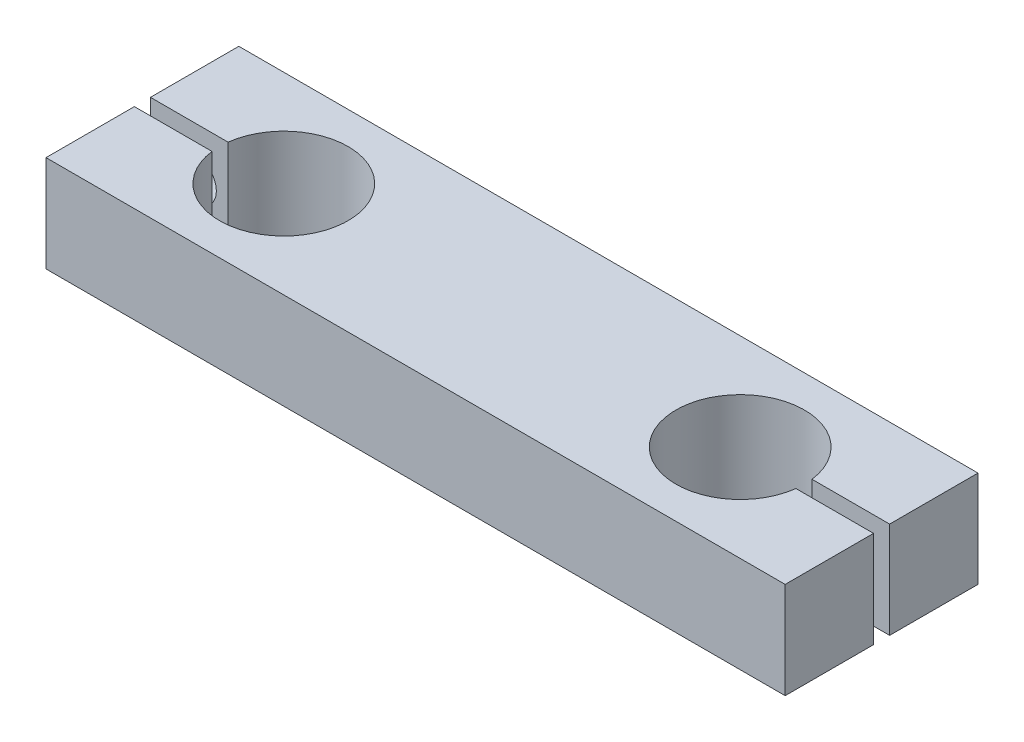
ISO-10303-21;
HEADER;
FILE_DESCRIPTION(('STEP AP214'),'2;1');
FILE_NAME('part.step','',(''),(''),'','','');
FILE_SCHEMA(('AUTOMOTIVE_DESIGN { 1 0 10303 214 1 1 1 1 }'));
ENDSEC;
DATA;
#1=APPLICATION_CONTEXT('core data for automotive mechanical design processes');
#2=APPLICATION_PROTOCOL_DEFINITION('international standard','automotive_design',2000,#1);
#3=PRODUCT_CONTEXT('',#1,'mechanical');
#4=PRODUCT('Part','Part','',(#3));
#5=PRODUCT_RELATED_PRODUCT_CATEGORY('part','',(#4));
#6=PRODUCT_DEFINITION_FORMATION('','',#4);
#7=PRODUCT_DEFINITION_CONTEXT('part definition',#1,'design');
#8=PRODUCT_DEFINITION('design','',#6,#7);
#9=PRODUCT_DEFINITION_SHAPE('','',#8);
#10=(LENGTH_UNIT() NAMED_UNIT(*) SI_UNIT(.MILLI.,.METRE.));
#11=(NAMED_UNIT(*) PLANE_ANGLE_UNIT() SI_UNIT($,.RADIAN.));
#12=(NAMED_UNIT(*) SI_UNIT($,.STERADIAN.) SOLID_ANGLE_UNIT());
#13=UNCERTAINTY_MEASURE_WITH_UNIT(LENGTH_MEASURE(1.E-05),#10,'distance_accuracy_value','');
#14=(GEOMETRIC_REPRESENTATION_CONTEXT(3) GLOBAL_UNCERTAINTY_ASSIGNED_CONTEXT((#13)) GLOBAL_UNIT_ASSIGNED_CONTEXT((#10,
#11,#12)) REPRESENTATION_CONTEXT('',''));
#15=CARTESIAN_POINT('',(0.,0.,0.));
#16=DIRECTION('',(0.,0.,1.));
#17=DIRECTION('',(1.,0.,0.));
#18=AXIS2_PLACEMENT_3D('',#15,#16,#17);
#19=CARTESIAN_POINT('',(35.5,15.,0.));
#20=DIRECTION('',(0.,-1.,0.));
#21=DIRECTION('',(0.,0.,-1.));
#22=AXIS2_PLACEMENT_3D('',#19,#20,#21);
#23=CYLINDRICAL_SURFACE('',#22,10.);
#24=CARTESIAN_POINT('',(35.5,0.,0.));
#25=DIRECTION('',(0.,1.,0.));
#26=DIRECTION('',(0.,0.,1.));
#27=AXIS2_PLACEMENT_3D('',#24,#25,#26);
#28=CIRCLE('',#27,10.);
#29=CARTESIAN_POINT('',(45.4215674164922,0.,-1.25));
#30=VERTEX_POINT('',#29);
#31=CARTESIAN_POINT('',(45.4215674164922,0.,1.25));
#32=VERTEX_POINT('',#31);
#33=EDGE_CURVE('E201',#30,#32,#28,.T.);
#34=ORIENTED_EDGE('',*,*,#33,.F.);
#35=DIRECTION('',(0.,-1.,0.));
#36=VECTOR('',#35,1.);
#37=CARTESIAN_POINT('',(45.4215674164922,15.,-1.25));
#38=LINE('',#37,#36);
#39=CARTESIAN_POINT('',(45.4215674164922,15.,-1.25));
#40=VERTEX_POINT('',#39);
#41=EDGE_CURVE('E11',#40,#30,#38,.T.);
#42=ORIENTED_EDGE('',*,*,#41,.F.);
#43=CARTESIAN_POINT('',(35.5,15.,0.));
#44=DIRECTION('',(0.,1.,0.));
#45=DIRECTION('',(0.,0.,1.));
#46=AXIS2_PLACEMENT_3D('',#43,#44,#45);
#47=CIRCLE('',#46,10.);
#48=CARTESIAN_POINT('',(45.4215674164922,15.,1.25));
#49=VERTEX_POINT('',#48);
#50=EDGE_CURVE('E178',#40,#49,#47,.T.);
#51=ORIENTED_EDGE('',*,*,#50,.T.);
#52=DIRECTION('',(0.,-1.,0.));
#53=VECTOR('',#52,1.);
#54=CARTESIAN_POINT('',(45.4215674164922,15.,1.25));
#55=LINE('',#54,#53);
#56=EDGE_CURVE('E106',#49,#32,#55,.T.);
#57=ORIENTED_EDGE('',*,*,#56,.T.);
#58=EDGE_LOOP('',(#34,#42,#51,#57));
#59=FACE_BOUND('',#58,.T.);
#60=ADVANCED_FACE('F41',(#59),#23,.F.);
#61=CARTESIAN_POINT('',(0.,15.,-1.25));
#62=DIRECTION('',(0.,0.,-1.));
#63=DIRECTION('',(-1.,0.,0.));
#64=AXIS2_PLACEMENT_3D('',#61,#62,#63);
#65=PLANE('',#64);
#66=CARTESIAN_POINT('',(50.5,7.5,-1.25));
#67=DIRECTION('',(0.,0.,-1.));
#68=DIRECTION('',(-1.,0.,0.));
#69=AXIS2_PLACEMENT_3D('',#66,#67,#68);
#70=CIRCLE('',#69,3.25);
#71=CARTESIAN_POINT('',(47.25,7.5,-1.25));
#72=VERTEX_POINT('',#71);
#73=EDGE_CURVE('E205',#72,#72,#70,.T.);
#74=ORIENTED_EDGE('',*,*,#73,.T.);
#75=EDGE_LOOP('',(#74));
#76=FACE_BOUND('',#75,.T.);
#77=DIRECTION('',(1.,0.,0.));
#78=VECTOR('',#77,1.);
#79=CARTESIAN_POINT('',(0.,0.,-1.25));
#80=LINE('',#79,#78);
#81=CARTESIAN_POINT('',(57.5,0.,-1.25));
#82=VERTEX_POINT('',#81);
#83=EDGE_CURVE('E288',#30,#82,#80,.T.);
#84=ORIENTED_EDGE('',*,*,#83,.T.);
#85=DIRECTION('',(0.,-1.,0.));
#86=VECTOR('',#85,1.);
#87=CARTESIAN_POINT('',(57.5,15.,-1.25));
#88=LINE('',#87,#86);
#89=CARTESIAN_POINT('',(57.5,15.,-1.25));
#90=VERTEX_POINT('',#89);
#91=EDGE_CURVE('E51',#90,#82,#88,.T.);
#92=ORIENTED_EDGE('',*,*,#91,.F.);
#93=DIRECTION('',(1.,0.,0.));
#94=VECTOR('',#93,1.);
#95=CARTESIAN_POINT('',(0.,15.,-1.25));
#96=LINE('',#95,#94);
#97=EDGE_CURVE('E171',#40,#90,#96,.T.);
#98=ORIENTED_EDGE('',*,*,#97,.F.);
#99=ORIENTED_EDGE('',*,*,#41,.T.);
#100=EDGE_LOOP('',(#84,#92,#98,#99));
#101=FACE_BOUND('',#100,.T.);
#102=ADVANCED_FACE('F349',(#76,#101),#65,.F.);
#103=CARTESIAN_POINT('',(57.5,15.,0.));
#104=DIRECTION('',(1.,0.,0.));
#105=DIRECTION('',(0.,0.,-1.));
#106=AXIS2_PLACEMENT_3D('',#103,#104,#105);
#107=PLANE('',#106);
#108=DIRECTION('',(0.,0.,1.));
#109=VECTOR('',#108,1.);
#110=CARTESIAN_POINT('',(57.5,0.,0.));
#111=LINE('',#110,#109);
#112=CARTESIAN_POINT('',(57.5,0.,-15.));
#113=VERTEX_POINT('',#112);
#114=EDGE_CURVE('E284',#113,#82,#111,.T.);
#115=ORIENTED_EDGE('',*,*,#114,.F.);
#116=DIRECTION('',(0.,-1.,0.));
#117=VECTOR('',#116,1.);
#118=CARTESIAN_POINT('',(57.5,15.,-15.));
#119=LINE('',#118,#117);
#120=CARTESIAN_POINT('',(57.5,15.,-15.));
#121=VERTEX_POINT('',#120);
#122=EDGE_CURVE('E234',#121,#113,#119,.T.);
#123=ORIENTED_EDGE('',*,*,#122,.F.);
#124=DIRECTION('',(0.,0.,1.));
#125=VECTOR('',#124,1.);
#126=CARTESIAN_POINT('',(57.5,15.,0.));
#127=LINE('',#126,#125);
#128=EDGE_CURVE('E163',#121,#90,#127,.T.);
#129=ORIENTED_EDGE('',*,*,#128,.T.);
#130=ORIENTED_EDGE('',*,*,#91,.T.);
#131=EDGE_LOOP('',(#115,#123,#129,#130));
#132=FACE_BOUND('',#131,.T.);
#133=ADVANCED_FACE('F353',(#132),#107,.T.);
#134=CARTESIAN_POINT('',(0.,15.,-15.));
#135=DIRECTION('',(0.,0.,-1.));
#136=DIRECTION('',(-1.,0.,0.));
#137=AXIS2_PLACEMENT_3D('',#134,#135,#136);
#138=PLANE('',#137);
#139=CARTESIAN_POINT('',(50.5,7.5,-15.));
#140=DIRECTION('',(0.,0.,-1.));
#141=DIRECTION('',(-1.,0.,0.));
#142=AXIS2_PLACEMENT_3D('',#139,#140,#141);
#143=CIRCLE('',#142,5.25);
#144=CARTESIAN_POINT('',(45.25,7.5,-15.));
#145=VERTEX_POINT('',#144);
#146=EDGE_CURVE('E193',#145,#145,#143,.T.);
#147=ORIENTED_EDGE('',*,*,#146,.F.);
#148=EDGE_LOOP('',(#147));
#149=FACE_BOUND('',#148,.T.);
#150=CARTESIAN_POINT('',(-50.5,7.5,-15.));
#151=DIRECTION('',(0.,0.,-1.));
#152=DIRECTION('',(-1.,0.,0.));
#153=AXIS2_PLACEMENT_3D('',#150,#151,#152);
#154=CIRCLE('',#153,5.25);
#155=CARTESIAN_POINT('',(-55.75,7.5,-15.));
#156=VERTEX_POINT('',#155);
#157=EDGE_CURVE('E184',#156,#156,#154,.T.);
#158=ORIENTED_EDGE('',*,*,#157,.F.);
#159=EDGE_LOOP('',(#158));
#160=FACE_BOUND('',#159,.T.);
#161=DIRECTION('',(1.,0.,0.));
#162=VECTOR('',#161,1.);
#163=CARTESIAN_POINT('',(0.,0.,-15.));
#164=LINE('',#163,#162);
#165=CARTESIAN_POINT('',(-57.5,0.,-15.));
#166=VERTEX_POINT('',#165);
#167=EDGE_CURVE('E280',#166,#113,#164,.T.);
#168=ORIENTED_EDGE('',*,*,#167,.F.);
#169=DIRECTION('',(0.,-1.,0.));
#170=VECTOR('',#169,1.);
#171=CARTESIAN_POINT('',(-57.5,15.,-15.));
#172=LINE('',#171,#170);
#173=CARTESIAN_POINT('',(-57.5,15.,-15.));
#174=VERTEX_POINT('',#173);
#175=EDGE_CURVE('E237',#174,#166,#172,.T.);
#176=ORIENTED_EDGE('',*,*,#175,.F.);
#177=DIRECTION('',(1.,0.,0.));
#178=VECTOR('',#177,1.);
#179=CARTESIAN_POINT('',(0.,15.,-15.));
#180=LINE('',#179,#178);
#181=EDGE_CURVE('E170',#174,#121,#180,.T.);
#182=ORIENTED_EDGE('',*,*,#181,.T.);
#183=ORIENTED_EDGE('',*,*,#122,.T.);
#184=EDGE_LOOP('',(#168,#176,#182,#183));
#185=FACE_BOUND('',#184,.T.);
#186=ADVANCED_FACE('F360',(#149,#160,#185),#138,.T.);
#187=CARTESIAN_POINT('',(-57.5,15.,0.));
#188=DIRECTION('',(1.,0.,0.));
#189=DIRECTION('',(0.,0.,-1.));
#190=AXIS2_PLACEMENT_3D('',#187,#188,#189);
#191=PLANE('',#190);
#192=DIRECTION('',(0.,0.,1.));
#193=VECTOR('',#192,1.);
#194=CARTESIAN_POINT('',(-57.5,0.,0.));
#195=LINE('',#194,#193);
#196=CARTESIAN_POINT('',(-57.5,0.,-1.25));
#197=VERTEX_POINT('',#196);
#198=EDGE_CURVE('E276',#166,#197,#195,.T.);
#199=ORIENTED_EDGE('',*,*,#198,.T.);
#200=DIRECTION('',(0.,-1.,0.));
#201=VECTOR('',#200,1.);
#202=CARTESIAN_POINT('',(-57.5,15.,-1.25));
#203=LINE('',#202,#201);
#204=CARTESIAN_POINT('',(-57.5,15.,-1.25));
#205=VERTEX_POINT('',#204);
#206=EDGE_CURVE('E240',#205,#197,#203,.T.);
#207=ORIENTED_EDGE('',*,*,#206,.F.);
#208=DIRECTION('',(0.,0.,1.));
#209=VECTOR('',#208,1.);
#210=CARTESIAN_POINT('',(-57.5,15.,0.));
#211=LINE('',#210,#209);
#212=EDGE_CURVE('E177',#174,#205,#211,.T.);
#213=ORIENTED_EDGE('',*,*,#212,.F.);
#214=ORIENTED_EDGE('',*,*,#175,.T.);
#215=EDGE_LOOP('',(#199,#207,#213,#214));
#216=FACE_BOUND('',#215,.T.);
#217=ADVANCED_FACE('F315',(#216),#191,.F.);
#218=CARTESIAN_POINT('',(0.,15.,-1.25));
#219=DIRECTION('',(0.,0.,1.));
#220=DIRECTION('',(1.,0.,0.));
#221=AXIS2_PLACEMENT_3D('',#218,#219,#220);
#222=PLANE('',#221);
#223=CARTESIAN_POINT('',(-50.5,7.5,-1.25));
#224=DIRECTION('',(0.,0.,1.));
#225=DIRECTION('',(1.,0.,0.));
#226=AXIS2_PLACEMENT_3D('',#223,#224,#225);
#227=CIRCLE('',#226,3.25);
#228=CARTESIAN_POINT('',(-47.25,7.5,-1.25));
#229=VERTEX_POINT('',#228);
#230=EDGE_CURVE('E189',#229,#229,#227,.T.);
#231=ORIENTED_EDGE('',*,*,#230,.F.);
#232=EDGE_LOOP('',(#231));
#233=FACE_BOUND('',#232,.T.);
#234=DIRECTION('',(-1.,0.,0.));
#235=VECTOR('',#234,1.);
#236=CARTESIAN_POINT('',(0.,0.,-1.25));
#237=LINE('',#236,#235);
#238=CARTESIAN_POINT('',(-45.4215674164922,0.,-1.25));
#239=VERTEX_POINT('',#238);
#240=EDGE_CURVE('E272',#239,#197,#237,.T.);
#241=ORIENTED_EDGE('',*,*,#240,.F.);
#242=DIRECTION('',(0.,-1.,0.));
#243=VECTOR('',#242,1.);
#244=CARTESIAN_POINT('',(-45.4215674164922,15.,-1.25));
#245=LINE('',#244,#243);
#246=CARTESIAN_POINT('',(-45.4215674164922,15.,-1.25));
#247=VERTEX_POINT('',#246);
#248=EDGE_CURVE('E243',#247,#239,#245,.T.);
#249=ORIENTED_EDGE('',*,*,#248,.F.);
#250=DIRECTION('',(-1.,0.,0.));
#251=VECTOR('',#250,1.);
#252=CARTESIAN_POINT('',(0.,15.,-1.25));
#253=LINE('',#252,#251);
#254=EDGE_CURVE('E303',#247,#205,#253,.T.);
#255=ORIENTED_EDGE('',*,*,#254,.T.);
#256=ORIENTED_EDGE('',*,*,#206,.T.);
#257=EDGE_LOOP('',(#241,#249,#255,#256));
#258=FACE_BOUND('',#257,.T.);
#259=ADVANCED_FACE('F319',(#233,#258),#222,.T.);
#260=CARTESIAN_POINT('',(-35.5,15.,0.));
#261=DIRECTION('',(0.,-1.,0.));
#262=DIRECTION('',(0.,0.,-1.));
#263=AXIS2_PLACEMENT_3D('',#260,#261,#262);
#264=CYLINDRICAL_SURFACE('',#263,10.);
#265=CARTESIAN_POINT('',(-35.5,0.,0.));
#266=DIRECTION('',(0.,1.,0.));
#267=DIRECTION('',(0.,0.,1.));
#268=AXIS2_PLACEMENT_3D('',#265,#266,#267);
#269=CIRCLE('',#268,10.);
#270=CARTESIAN_POINT('',(-45.4215674164922,0.,1.25000000000001));
#271=VERTEX_POINT('',#270);
#272=EDGE_CURVE('E268',#271,#239,#269,.T.);
#273=ORIENTED_EDGE('',*,*,#272,.F.);
#274=DIRECTION('',(0.,-1.,0.));
#275=VECTOR('',#274,1.);
#276=CARTESIAN_POINT('',(-45.4215674164922,15.,1.25000000000001));
#277=LINE('',#276,#275);
#278=CARTESIAN_POINT('',(-45.4215674164922,15.,1.25000000000001));
#279=VERTEX_POINT('',#278);
#280=EDGE_CURVE('E246',#279,#271,#277,.T.);
#281=ORIENTED_EDGE('',*,*,#280,.F.);
#282=CARTESIAN_POINT('',(-35.5,15.,0.));
#283=DIRECTION('',(0.,1.,0.));
#284=DIRECTION('',(0.,0.,1.));
#285=AXIS2_PLACEMENT_3D('',#282,#283,#284);
#286=CIRCLE('',#285,10.);
#287=EDGE_CURVE('E299',#279,#247,#286,.T.);
#288=ORIENTED_EDGE('',*,*,#287,.T.);
#289=ORIENTED_EDGE('',*,*,#248,.T.);
#290=EDGE_LOOP('',(#273,#281,#288,#289));
#291=FACE_BOUND('',#290,.T.);
#292=ADVANCED_FACE('F322',(#291),#264,.F.);
#293=CARTESIAN_POINT('',(0.,15.,1.25000000000001));
#294=DIRECTION('',(0.,0.,-1.));
#295=DIRECTION('',(-1.,0.,0.));
#296=AXIS2_PLACEMENT_3D('',#293,#294,#295);
#297=PLANE('',#296);
#298=CARTESIAN_POINT('',(-50.5,7.5,1.25));
#299=DIRECTION('',(0.,0.,-1.));
#300=DIRECTION('',(-1.,0.,0.));
#301=AXIS2_PLACEMENT_3D('',#298,#299,#300);
#302=CIRCLE('',#301,3.25);
#303=CARTESIAN_POINT('',(-53.75,7.5,1.25));
#304=VERTEX_POINT('',#303);
#305=EDGE_CURVE('E44',#304,#304,#302,.T.);
#306=ORIENTED_EDGE('',*,*,#305,.F.);
#307=EDGE_LOOP('',(#306));
#308=FACE_BOUND('',#307,.T.);
#309=DIRECTION('',(1.,0.,0.));
#310=VECTOR('',#309,1.);
#311=CARTESIAN_POINT('',(0.,0.,1.25000000000001));
#312=LINE('',#311,#310);
#313=CARTESIAN_POINT('',(-57.5,0.,1.25000000000001));
#314=VERTEX_POINT('',#313);
#315=EDGE_CURVE('E264',#314,#271,#312,.T.);
#316=ORIENTED_EDGE('',*,*,#315,.F.);
#317=DIRECTION('',(0.,-1.,0.));
#318=VECTOR('',#317,1.);
#319=CARTESIAN_POINT('',(-57.5,15.,1.25000000000001));
#320=LINE('',#319,#318);
#321=CARTESIAN_POINT('',(-57.5,15.,1.25000000000001));
#322=VERTEX_POINT('',#321);
#323=EDGE_CURVE('E249',#322,#314,#320,.T.);
#324=ORIENTED_EDGE('',*,*,#323,.F.);
#325=DIRECTION('',(1.,0.,0.));
#326=VECTOR('',#325,1.);
#327=CARTESIAN_POINT('',(0.,15.,1.25000000000001));
#328=LINE('',#327,#326);
#329=EDGE_CURVE('E295',#322,#279,#328,.T.);
#330=ORIENTED_EDGE('',*,*,#329,.T.);
#331=ORIENTED_EDGE('',*,*,#280,.T.);
#332=EDGE_LOOP('',(#316,#324,#330,#331));
#333=FACE_BOUND('',#332,.T.);
#334=ADVANCED_FACE('F325',(#308,#333),#297,.T.);
#335=CARTESIAN_POINT('',(-57.5,0.,15.));
#336=VERTEX_POINT('',#335);
#337=EDGE_CURVE('E263',#314,#336,#195,.T.);
#338=ORIENTED_EDGE('',*,*,#337,.T.);
#339=DIRECTION('',(0.,-1.,0.));
#340=VECTOR('',#339,1.);
#341=CARTESIAN_POINT('',(-57.5,15.,15.));
#342=LINE('',#341,#340);
#343=CARTESIAN_POINT('',(-57.5,15.,15.));
#344=VERTEX_POINT('',#343);
#345=EDGE_CURVE('E158',#344,#336,#342,.T.);
#346=ORIENTED_EDGE('',*,*,#345,.F.);
#347=EDGE_CURVE('E143',#322,#344,#211,.T.);
#348=ORIENTED_EDGE('',*,*,#347,.F.);
#349=ORIENTED_EDGE('',*,*,#323,.T.);
#350=EDGE_LOOP('',(#338,#346,#348,#349));
#351=FACE_BOUND('',#350,.T.);
#352=ADVANCED_FACE('F328',(#351),#191,.F.);
#353=CARTESIAN_POINT('',(0.,15.,15.));
#354=DIRECTION('',(0.,0.,-1.));
#355=DIRECTION('',(-1.,0.,0.));
#356=AXIS2_PLACEMENT_3D('',#353,#354,#355);
#357=PLANE('',#356);
#358=DIRECTION('',(1.,0.,0.));
#359=VECTOR('',#358,1.);
#360=CARTESIAN_POINT('',(0.,0.,15.));
#361=LINE('',#360,#359);
#362=CARTESIAN_POINT('',(57.5,0.,15.));
#363=VERTEX_POINT('',#362);
#364=EDGE_CURVE('E153',#336,#363,#361,.T.);
#365=ORIENTED_EDGE('',*,*,#364,.T.);
#366=DIRECTION('',(0.,-1.,0.));
#367=VECTOR('',#366,1.);
#368=CARTESIAN_POINT('',(57.5,15.,15.));
#369=LINE('',#368,#367);
#370=CARTESIAN_POINT('',(57.5,15.,15.));
#371=VERTEX_POINT('',#370);
#372=EDGE_CURVE('E150',#371,#363,#369,.T.);
#373=ORIENTED_EDGE('',*,*,#372,.F.);
#374=DIRECTION('',(1.,0.,0.));
#375=VECTOR('',#374,1.);
#376=CARTESIAN_POINT('',(0.,15.,15.));
#377=LINE('',#376,#375);
#378=EDGE_CURVE('E136',#344,#371,#377,.T.);
#379=ORIENTED_EDGE('',*,*,#378,.F.);
#380=ORIENTED_EDGE('',*,*,#345,.T.);
#381=EDGE_LOOP('',(#365,#373,#379,#380));
#382=FACE_BOUND('',#381,.T.);
#383=ADVANCED_FACE('F151',(#382),#357,.F.);
#384=CARTESIAN_POINT('',(57.5,0.,1.25));
#385=VERTEX_POINT('',#384);
#386=EDGE_CURVE('E260',#385,#363,#111,.T.);
#387=ORIENTED_EDGE('',*,*,#386,.F.);
#388=DIRECTION('',(0.,-1.,0.));
#389=VECTOR('',#388,1.);
#390=CARTESIAN_POINT('',(57.5,15.,1.25));
#391=LINE('',#390,#389);
#392=CARTESIAN_POINT('',(57.5,15.,1.25));
#393=VERTEX_POINT('',#392);
#394=EDGE_CURVE('E99',#393,#385,#391,.T.);
#395=ORIENTED_EDGE('',*,*,#394,.F.);
#396=EDGE_CURVE('E140',#393,#371,#127,.T.);
#397=ORIENTED_EDGE('',*,*,#396,.T.);
#398=ORIENTED_EDGE('',*,*,#372,.T.);
#399=EDGE_LOOP('',(#387,#395,#397,#398));
#400=FACE_BOUND('',#399,.T.);
#401=ADVANCED_FACE('F160',(#400),#107,.T.);
#402=CARTESIAN_POINT('',(0.,15.,1.25));
#403=DIRECTION('',(0.,0.,1.));
#404=DIRECTION('',(1.,0.,0.));
#405=AXIS2_PLACEMENT_3D('',#402,#403,#404);
#406=PLANE('',#405);
#407=CARTESIAN_POINT('',(50.5,7.5,1.25));
#408=DIRECTION('',(0.,0.,1.));
#409=DIRECTION('',(1.,0.,0.));
#410=AXIS2_PLACEMENT_3D('',#407,#408,#409);
#411=CIRCLE('',#410,3.25);
#412=CARTESIAN_POINT('',(53.75,7.5,1.25));
#413=VERTEX_POINT('',#412);
#414=EDGE_CURVE('E209',#413,#413,#411,.T.);
#415=ORIENTED_EDGE('',*,*,#414,.T.);
#416=EDGE_LOOP('',(#415));
#417=FACE_BOUND('',#416,.T.);
#418=DIRECTION('',(-1.,0.,0.));
#419=VECTOR('',#418,1.);
#420=CARTESIAN_POINT('',(0.,0.,1.25));
#421=LINE('',#420,#419);
#422=EDGE_CURVE('E181',#385,#32,#421,.T.);
#423=ORIENTED_EDGE('',*,*,#422,.T.);
#424=ORIENTED_EDGE('',*,*,#56,.F.);
#425=DIRECTION('',(-1.,0.,0.));
#426=VECTOR('',#425,1.);
#427=CARTESIAN_POINT('',(0.,15.,1.25));
#428=LINE('',#427,#426);
#429=EDGE_CURVE('E60',#393,#49,#428,.T.);
#430=ORIENTED_EDGE('',*,*,#429,.F.);
#431=ORIENTED_EDGE('',*,*,#394,.T.);
#432=EDGE_LOOP('',(#423,#424,#430,#431));
#433=FACE_BOUND('',#432,.T.);
#434=ADVANCED_FACE('F404',(#417,#433),#406,.F.);
#435=CARTESIAN_POINT('',(0.,15.,0.));
#436=DIRECTION('',(0.,1.,0.));
#437=DIRECTION('',(0.,0.,1.));
#438=AXIS2_PLACEMENT_3D('',#435,#436,#437);
#439=PLANE('',#438);
#440=ORIENTED_EDGE('',*,*,#50,.F.);
#441=ORIENTED_EDGE('',*,*,#97,.T.);
#442=ORIENTED_EDGE('',*,*,#128,.F.);
#443=ORIENTED_EDGE('',*,*,#181,.F.);
#444=ORIENTED_EDGE('',*,*,#212,.T.);
#445=ORIENTED_EDGE('',*,*,#254,.F.);
#446=ORIENTED_EDGE('',*,*,#287,.F.);
#447=ORIENTED_EDGE('',*,*,#329,.F.);
#448=ORIENTED_EDGE('',*,*,#347,.T.);
#449=ORIENTED_EDGE('',*,*,#378,.T.);
#450=ORIENTED_EDGE('',*,*,#396,.F.);
#451=ORIENTED_EDGE('',*,*,#429,.T.);
#452=EDGE_LOOP('',(#440,#441,#442,#443,#444,#445,#446,#447,#448,#449,#450,#451));
#453=FACE_BOUND('',#452,.T.);
#454=ADVANCED_FACE('F138',(#453),#439,.T.);
#455=CARTESIAN_POINT('',(0.,0.,0.));
#456=DIRECTION('',(0.,1.,0.));
#457=DIRECTION('',(0.,0.,1.));
#458=AXIS2_PLACEMENT_3D('',#455,#456,#457);
#459=PLANE('',#458);
#460=ORIENTED_EDGE('',*,*,#33,.T.);
#461=ORIENTED_EDGE('',*,*,#422,.F.);
#462=ORIENTED_EDGE('',*,*,#386,.T.);
#463=ORIENTED_EDGE('',*,*,#364,.F.);
#464=ORIENTED_EDGE('',*,*,#337,.F.);
#465=ORIENTED_EDGE('',*,*,#315,.T.);
#466=ORIENTED_EDGE('',*,*,#272,.T.);
#467=ORIENTED_EDGE('',*,*,#240,.T.);
#468=ORIENTED_EDGE('',*,*,#198,.F.);
#469=ORIENTED_EDGE('',*,*,#167,.T.);
#470=ORIENTED_EDGE('',*,*,#114,.T.);
#471=ORIENTED_EDGE('',*,*,#83,.F.);
#472=EDGE_LOOP('',(#460,#461,#462,#463,#464,#465,#466,#467,#468,#469,#470,#471));
#473=FACE_BOUND('',#472,.T.);
#474=ADVANCED_FACE('F330',(#473),#459,.F.);
#475=CARTESIAN_POINT('',(-50.5,7.5,-8.));
#476=DIRECTION('',(0.,0.,-1.));
#477=DIRECTION('',(-1.,0.,0.));
#478=AXIS2_PLACEMENT_3D('',#475,#476,#477);
#479=CYLINDRICAL_SURFACE('',#478,5.25);
#480=CARTESIAN_POINT('',(-50.5,7.5,-8.));
#481=DIRECTION('',(0.,0.,-1.));
#482=DIRECTION('',(-1.,0.,0.));
#483=AXIS2_PLACEMENT_3D('',#480,#481,#482);
#484=CIRCLE('',#483,5.25);
#485=CARTESIAN_POINT('',(-55.75,7.5,-8.));
#486=VERTEX_POINT('',#485);
#487=EDGE_CURVE('E188',#486,#486,#484,.T.);
#488=ORIENTED_EDGE('',*,*,#487,.F.);
#489=EDGE_LOOP('',(#488));
#490=FACE_BOUND('',#489,.T.);
#491=ORIENTED_EDGE('',*,*,#157,.T.);
#492=EDGE_LOOP('',(#491));
#493=FACE_BOUND('',#492,.T.);
#494=ADVANCED_FACE('F389',(#490,#493),#479,.F.);
#495=CARTESIAN_POINT('',(-50.5,7.5,-8.));
#496=DIRECTION('',(0.,0.,-1.));
#497=DIRECTION('',(-1.,0.,0.));
#498=AXIS2_PLACEMENT_3D('',#495,#496,#497);
#499=PLANE('',#498);
#500=CARTESIAN_POINT('',(-50.5,7.5,-8.));
#501=DIRECTION('',(0.,0.,-1.));
#502=DIRECTION('',(-1.,0.,0.));
#503=AXIS2_PLACEMENT_3D('',#500,#501,#502);
#504=CIRCLE('',#503,3.25);
#505=CARTESIAN_POINT('',(-53.75,7.5,-8.));
#506=VERTEX_POINT('',#505);
#507=EDGE_CURVE('E210',#506,#506,#504,.T.);
#508=ORIENTED_EDGE('',*,*,#507,.F.);
#509=EDGE_LOOP('',(#508));
#510=FACE_BOUND('',#509,.T.);
#511=ORIENTED_EDGE('',*,*,#487,.T.);
#512=EDGE_LOOP('',(#511));
#513=FACE_BOUND('',#512,.T.);
#514=ADVANCED_FACE('F385',(#510,#513),#499,.T.);
#515=CARTESIAN_POINT('',(50.5,7.5,-8.));
#516=DIRECTION('',(0.,0.,-1.));
#517=DIRECTION('',(-1.,0.,0.));
#518=AXIS2_PLACEMENT_3D('',#515,#516,#517);
#519=CYLINDRICAL_SURFACE('',#518,5.25);
#520=CARTESIAN_POINT('',(50.5,7.5,-8.));
#521=DIRECTION('',(0.,0.,-1.));
#522=DIRECTION('',(-1.,0.,0.));
#523=AXIS2_PLACEMENT_3D('',#520,#521,#522);
#524=CIRCLE('',#523,5.25);
#525=CARTESIAN_POINT('',(45.25,7.5,-8.));
#526=VERTEX_POINT('',#525);
#527=EDGE_CURVE('E197',#526,#526,#524,.T.);
#528=ORIENTED_EDGE('',*,*,#527,.F.);
#529=EDGE_LOOP('',(#528));
#530=FACE_BOUND('',#529,.T.);
#531=ORIENTED_EDGE('',*,*,#146,.T.);
#532=EDGE_LOOP('',(#531));
#533=FACE_BOUND('',#532,.T.);
#534=ADVANCED_FACE('F388',(#530,#533),#519,.F.);
#535=CARTESIAN_POINT('',(50.5,7.5,-8.));
#536=DIRECTION('',(0.,0.,-1.));
#537=DIRECTION('',(-1.,0.,0.));
#538=AXIS2_PLACEMENT_3D('',#535,#536,#537);
#539=PLANE('',#538);
#540=CARTESIAN_POINT('',(50.5,7.5,-8.));
#541=DIRECTION('',(0.,0.,-1.));
#542=DIRECTION('',(-1.,0.,0.));
#543=AXIS2_PLACEMENT_3D('',#540,#541,#542);
#544=CIRCLE('',#543,3.25);
#545=CARTESIAN_POINT('',(47.25,7.5,-8.));
#546=VERTEX_POINT('',#545);
#547=EDGE_CURVE('E218',#546,#546,#544,.T.);
#548=ORIENTED_EDGE('',*,*,#547,.F.);
#549=EDGE_LOOP('',(#548));
#550=FACE_BOUND('',#549,.T.);
#551=ORIENTED_EDGE('',*,*,#527,.T.);
#552=EDGE_LOOP('',(#551));
#553=FACE_BOUND('',#552,.T.);
#554=ADVANCED_FACE('F451',(#550,#553),#539,.T.);
#555=CARTESIAN_POINT('',(50.5,7.5,12.));
#556=DIRECTION('',(0.,0.,-1.));
#557=DIRECTION('',(-1.,0.,0.));
#558=AXIS2_PLACEMENT_3D('',#555,#556,#557);
#559=PLANE('',#558);
#560=CARTESIAN_POINT('',(50.5,7.5,12.));
#561=DIRECTION('',(0.,0.,-1.));
#562=DIRECTION('',(-1.,0.,0.));
#563=AXIS2_PLACEMENT_3D('',#560,#561,#562);
#564=CIRCLE('',#563,3.25);
#565=CARTESIAN_POINT('',(47.25,7.5,12.));
#566=VERTEX_POINT('',#565);
#567=EDGE_CURVE('E222',#566,#566,#564,.T.);
#568=ORIENTED_EDGE('',*,*,#567,.T.);
#569=EDGE_LOOP('',(#568));
#570=FACE_BOUND('',#569,.T.);
#571=ADVANCED_FACE('F507',(#570),#559,.T.);
#572=CARTESIAN_POINT('',(50.5,7.5,12.));
#573=DIRECTION('',(0.,0.,-1.));
#574=DIRECTION('',(-1.,0.,0.));
#575=AXIS2_PLACEMENT_3D('',#572,#573,#574);
#576=CYLINDRICAL_SURFACE('',#575,3.25);
#577=ORIENTED_EDGE('',*,*,#567,.F.);
#578=EDGE_LOOP('',(#577));
#579=FACE_BOUND('',#578,.T.);
#580=ORIENTED_EDGE('',*,*,#414,.F.);
#581=EDGE_LOOP('',(#580));
#582=FACE_BOUND('',#581,.T.);
#583=ADVANCED_FACE('F514',(#579,#582),#576,.F.);
#584=CARTESIAN_POINT('',(-50.5,7.5,12.));
#585=DIRECTION('',(0.,0.,-1.));
#586=DIRECTION('',(-1.,0.,0.));
#587=AXIS2_PLACEMENT_3D('',#584,#585,#586);
#588=PLANE('',#587);
#589=CARTESIAN_POINT('',(-50.5,7.5,12.));
#590=DIRECTION('',(0.,0.,-1.));
#591=DIRECTION('',(-1.,0.,0.));
#592=AXIS2_PLACEMENT_3D('',#589,#590,#591);
#593=CIRCLE('',#592,3.25);
#594=CARTESIAN_POINT('',(-53.75,7.5,12.));
#595=VERTEX_POINT('',#594);
#596=EDGE_CURVE('E214',#595,#595,#593,.T.);
#597=ORIENTED_EDGE('',*,*,#596,.T.);
#598=EDGE_LOOP('',(#597));
#599=FACE_BOUND('',#598,.T.);
#600=ADVANCED_FACE('F521',(#599),#588,.T.);
#601=CARTESIAN_POINT('',(-50.5,7.5,12.));
#602=DIRECTION('',(0.,0.,-1.));
#603=DIRECTION('',(-1.,0.,0.));
#604=AXIS2_PLACEMENT_3D('',#601,#602,#603);
#605=CYLINDRICAL_SURFACE('',#604,3.25);
#606=ORIENTED_EDGE('',*,*,#305,.T.);
#607=EDGE_LOOP('',(#606));
#608=FACE_BOUND('',#607,.T.);
#609=ORIENTED_EDGE('',*,*,#596,.F.);
#610=EDGE_LOOP('',(#609));
#611=FACE_BOUND('',#610,.T.);
#612=ADVANCED_FACE('F337',(#608,#611),#605,.F.);
#613=ORIENTED_EDGE('',*,*,#230,.T.);
#614=EDGE_LOOP('',(#613));
#615=FACE_BOUND('',#614,.T.);
#616=ORIENTED_EDGE('',*,*,#507,.T.);
#617=EDGE_LOOP('',(#616));
#618=FACE_BOUND('',#617,.T.);
#619=ADVANCED_FACE('F378',(#615,#618),#605,.F.);
#620=ORIENTED_EDGE('',*,*,#547,.T.);
#621=EDGE_LOOP('',(#620));
#622=FACE_BOUND('',#621,.T.);
#623=ORIENTED_EDGE('',*,*,#73,.F.);
#624=EDGE_LOOP('',(#623));
#625=FACE_BOUND('',#624,.T.);
#626=ADVANCED_FACE('F381',(#622,#625),#576,.F.);
#627=CLOSED_SHELL('',(#60,#102,#133,#186,#217,#259,#292,#334,#352,#383,#401,#434,#454,#474,#494,
#514,#534,#554,#571,#583,#600,#612,#619,#626));
#628=MANIFOLD_SOLID_BREP('B2',#627);
#629=ADVANCED_BREP_SHAPE_REPRESENTATION('',(#18,#628),#14);
#630=SHAPE_DEFINITION_REPRESENTATION(#9,#629);
ENDSEC;
END-ISO-10303-21;
